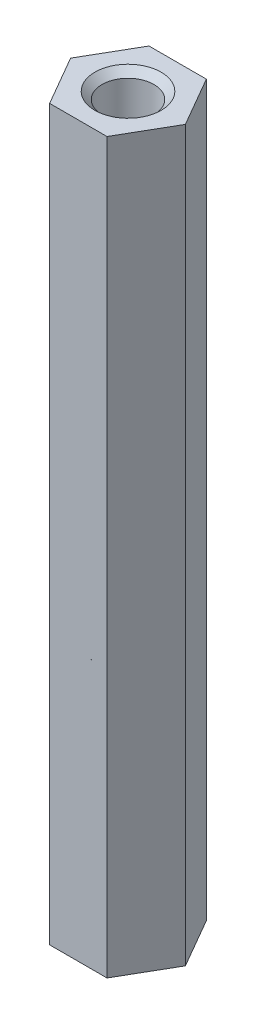
ISO-10303-21;
HEADER;
FILE_DESCRIPTION(('STEP AP214'),'2;1');
FILE_NAME('part.step','',(''),(''),'','','');
FILE_SCHEMA(('AUTOMOTIVE_DESIGN { 1 0 10303 214 1 1 1 1 }'));
ENDSEC;
DATA;
#1=APPLICATION_CONTEXT('core data for automotive mechanical design processes');
#2=APPLICATION_PROTOCOL_DEFINITION('international standard','automotive_design',2000,#1);
#3=PRODUCT_CONTEXT('',#1,'mechanical');
#4=PRODUCT('Part','Part','',(#3));
#5=PRODUCT_RELATED_PRODUCT_CATEGORY('part','',(#4));
#6=PRODUCT_DEFINITION_FORMATION('','',#4);
#7=PRODUCT_DEFINITION_CONTEXT('part definition',#1,'design');
#8=PRODUCT_DEFINITION('design','',#6,#7);
#9=PRODUCT_DEFINITION_SHAPE('','',#8);
#10=(LENGTH_UNIT() NAMED_UNIT(*) SI_UNIT(.MILLI.,.METRE.));
#11=(NAMED_UNIT(*) PLANE_ANGLE_UNIT() SI_UNIT($,.RADIAN.));
#12=(NAMED_UNIT(*) SI_UNIT($,.STERADIAN.) SOLID_ANGLE_UNIT());
#13=UNCERTAINTY_MEASURE_WITH_UNIT(LENGTH_MEASURE(1.E-05),#10,'distance_accuracy_value','');
#14=(GEOMETRIC_REPRESENTATION_CONTEXT(3) GLOBAL_UNCERTAINTY_ASSIGNED_CONTEXT((#13)) GLOBAL_UNIT_ASSIGNED_CONTEXT((#10,
#11,#12)) REPRESENTATION_CONTEXT('',''));
#15=CARTESIAN_POINT('',(0.,0.,0.));
#16=DIRECTION('',(0.,0.,1.));
#17=DIRECTION('',(1.,0.,0.));
#18=AXIS2_PLACEMENT_3D('',#15,#16,#17);
#19=CARTESIAN_POINT('',(0.866025403784438,22.,-1.5));
#20=DIRECTION('',(0.,0.,1.));
#21=DIRECTION('',(1.,0.,0.));
#22=AXIS2_PLACEMENT_3D('',#19,#20,#21);
#23=PLANE('',#22);
#24=DIRECTION('',(0.,1.,0.));
#25=VECTOR('',#24,1.);
#26=CARTESIAN_POINT('',(-0.866025403784439,22.,-1.5));
#27=LINE('',#26,#25);
#28=CARTESIAN_POINT('',(-0.866025403784438,0.,-1.5));
#29=VERTEX_POINT('',#28);
#30=CARTESIAN_POINT('',(-0.866025403784438,22.,-1.5));
#31=VERTEX_POINT('',#30);
#32=EDGE_CURVE('E83',#29,#31,#27,.T.);
#33=ORIENTED_EDGE('',*,*,#32,.T.);
#34=DIRECTION('',(1.,0.,0.));
#35=VECTOR('',#34,1.);
#36=CARTESIAN_POINT('',(0.866025403784438,22.,-1.5));
#37=LINE('',#36,#35);
#38=CARTESIAN_POINT('',(0.866025403784438,22.,-1.5));
#39=VERTEX_POINT('',#38);
#40=EDGE_CURVE('E71',#39,#31,#37,.F.);
#41=ORIENTED_EDGE('',*,*,#40,.F.);
#42=DIRECTION('',(0.,1.,0.));
#43=VECTOR('',#42,1.);
#44=CARTESIAN_POINT('',(0.866025403784438,22.,-1.5));
#45=LINE('',#44,#43);
#46=CARTESIAN_POINT('',(0.866025403784438,0.,-1.5));
#47=VERTEX_POINT('',#46);
#48=EDGE_CURVE('E126',#39,#47,#45,.F.);
#49=ORIENTED_EDGE('',*,*,#48,.T.);
#50=DIRECTION('',(1.,0.,0.));
#51=VECTOR('',#50,1.);
#52=CARTESIAN_POINT('',(0.866025403784438,0.,-1.5));
#53=LINE('',#52,#51);
#54=EDGE_CURVE('E67',#29,#47,#53,.T.);
#55=ORIENTED_EDGE('',*,*,#54,.F.);
#56=EDGE_LOOP('',(#33,#41,#49,#55));
#57=FACE_BOUND('',#56,.T.);
#58=ADVANCED_FACE('F17',(#57),#23,.F.);
#59=CARTESIAN_POINT('',(-0.866025403784439,22.,-1.5));
#60=DIRECTION('',(0.866025403784439,0.,0.5));
#61=DIRECTION('',(0.5,0.,-0.866025403784439));
#62=AXIS2_PLACEMENT_3D('',#59,#60,#61);
#63=PLANE('',#62);
#64=DIRECTION('',(0.,1.,0.));
#65=VECTOR('',#64,1.);
#66=CARTESIAN_POINT('',(-1.73205080756888,22.,0.));
#67=LINE('',#66,#65);
#68=CARTESIAN_POINT('',(-1.73205080756888,0.,0.));
#69=VERTEX_POINT('',#68);
#70=CARTESIAN_POINT('',(-1.73205080756888,22.,0.));
#71=VERTEX_POINT('',#70);
#72=EDGE_CURVE('E86',#69,#71,#67,.T.);
#73=ORIENTED_EDGE('',*,*,#72,.T.);
#74=DIRECTION('',(0.5,0.,-0.866025403784439));
#75=VECTOR('',#74,1.);
#76=CARTESIAN_POINT('',(-0.866025403784439,22.,-1.5));
#77=LINE('',#76,#75);
#78=EDGE_CURVE('E75',#31,#71,#77,.F.);
#79=ORIENTED_EDGE('',*,*,#78,.F.);
#80=ORIENTED_EDGE('',*,*,#32,.F.);
#81=DIRECTION('',(0.5,0.,-0.866025403784439));
#82=VECTOR('',#81,1.);
#83=CARTESIAN_POINT('',(-0.866025403784439,0.,-1.5));
#84=LINE('',#83,#82);
#85=EDGE_CURVE('E87',#69,#29,#84,.T.);
#86=ORIENTED_EDGE('',*,*,#85,.F.);
#87=EDGE_LOOP('',(#73,#79,#80,#86));
#88=FACE_BOUND('',#87,.T.);
#89=ADVANCED_FACE('F82',(#88),#63,.F.);
#90=CARTESIAN_POINT('',(1.7320508075689,22.,0.));
#91=DIRECTION('',(-0.866025403784434,0.,0.500000000000008));
#92=DIRECTION('',(0.500000000000008,0.,0.866025403784434));
#93=AXIS2_PLACEMENT_3D('',#90,#91,#92);
#94=PLANE('',#93);
#95=ORIENTED_EDGE('',*,*,#48,.F.);
#96=DIRECTION('',(0.500000000000008,0.,0.866025403784434));
#97=VECTOR('',#96,1.);
#98=CARTESIAN_POINT('',(1.7320508075689,22.,0.));
#99=LINE('',#98,#97);
#100=CARTESIAN_POINT('',(1.7320508075689,22.,0.));
#101=VERTEX_POINT('',#100);
#102=EDGE_CURVE('E77',#101,#39,#99,.F.);
#103=ORIENTED_EDGE('',*,*,#102,.F.);
#104=DIRECTION('',(0.,1.,0.));
#105=VECTOR('',#104,1.);
#106=CARTESIAN_POINT('',(1.7320508075689,22.,0.));
#107=LINE('',#106,#105);
#108=CARTESIAN_POINT('',(1.7320508075689,0.,0.));
#109=VERTEX_POINT('',#108);
#110=EDGE_CURVE('E113',#101,#109,#107,.F.);
#111=ORIENTED_EDGE('',*,*,#110,.T.);
#112=DIRECTION('',(0.500000000000008,0.,0.866025403784434));
#113=VECTOR('',#112,1.);
#114=CARTESIAN_POINT('',(1.7320508075689,0.,0.));
#115=LINE('',#114,#113);
#116=EDGE_CURVE('E124',#47,#109,#115,.T.);
#117=ORIENTED_EDGE('',*,*,#116,.F.);
#118=EDGE_LOOP('',(#95,#103,#111,#117));
#119=FACE_BOUND('',#118,.T.);
#120=ADVANCED_FACE('F143',(#119),#94,.F.);
#121=CARTESIAN_POINT('',(-1.73205080756888,22.,0.));
#122=DIRECTION('',(0.866025403784439,0.,-0.5));
#123=DIRECTION('',(-0.5,0.,-0.866025403784439));
#124=AXIS2_PLACEMENT_3D('',#121,#122,#123);
#125=PLANE('',#124);
#126=DIRECTION('',(0.,1.,0.));
#127=VECTOR('',#126,1.);
#128=CARTESIAN_POINT('',(-0.866025403784439,22.,1.5));
#129=LINE('',#128,#127);
#130=CARTESIAN_POINT('',(-0.866025403784439,0.,1.5));
#131=VERTEX_POINT('',#130);
#132=CARTESIAN_POINT('',(-0.866025403784439,22.,1.5));
#133=VERTEX_POINT('',#132);
#134=EDGE_CURVE('E112',#131,#133,#129,.T.);
#135=ORIENTED_EDGE('',*,*,#134,.T.);
#136=DIRECTION('',(-0.5,0.,-0.866025403784439));
#137=VECTOR('',#136,1.);
#138=CARTESIAN_POINT('',(-1.73205080756888,22.,0.));
#139=LINE('',#138,#137);
#140=EDGE_CURVE('E35',#71,#133,#139,.F.);
#141=ORIENTED_EDGE('',*,*,#140,.F.);
#142=ORIENTED_EDGE('',*,*,#72,.F.);
#143=DIRECTION('',(-0.5,0.,-0.866025403784439));
#144=VECTOR('',#143,1.);
#145=CARTESIAN_POINT('',(-1.73205080756888,0.,0.));
#146=LINE('',#145,#144);
#147=EDGE_CURVE('E119',#131,#69,#146,.T.);
#148=ORIENTED_EDGE('',*,*,#147,.F.);
#149=EDGE_LOOP('',(#135,#141,#142,#148));
#150=FACE_BOUND('',#149,.T.);
#151=ADVANCED_FACE('F133',(#150),#125,.F.);
#152=CARTESIAN_POINT('',(0.866025403784439,22.,1.5));
#153=DIRECTION('',(-0.866025403784432,0.,-0.500000000000011));
#154=DIRECTION('',(-0.500000000000011,0.,0.866025403784432));
#155=AXIS2_PLACEMENT_3D('',#152,#153,#154);
#156=PLANE('',#155);
#157=ORIENTED_EDGE('',*,*,#110,.F.);
#158=DIRECTION('',(-0.500000000000011,0.,0.866025403784432));
#159=VECTOR('',#158,1.);
#160=CARTESIAN_POINT('',(0.866025403784439,22.,1.5));
#161=LINE('',#160,#159);
#162=CARTESIAN_POINT('',(0.866025403784439,22.,1.5));
#163=VERTEX_POINT('',#162);
#164=EDGE_CURVE('E117',#163,#101,#161,.F.);
#165=ORIENTED_EDGE('',*,*,#164,.F.);
#166=DIRECTION('',(0.,1.,0.));
#167=VECTOR('',#166,1.);
#168=CARTESIAN_POINT('',(0.866025403784439,22.,1.5));
#169=LINE('',#168,#167);
#170=CARTESIAN_POINT('',(0.866025403784439,0.,1.5));
#171=VERTEX_POINT('',#170);
#172=EDGE_CURVE('E109',#163,#171,#169,.F.);
#173=ORIENTED_EDGE('',*,*,#172,.T.);
#174=DIRECTION('',(0.500000000000011,0.,-0.866025403784432));
#175=VECTOR('',#174,1.);
#176=CARTESIAN_POINT('',(0.866025403784439,0.,1.5));
#177=LINE('',#176,#175);
#178=EDGE_CURVE('E101',#171,#109,#177,.T.);
#179=ORIENTED_EDGE('',*,*,#178,.T.);
#180=EDGE_LOOP('',(#157,#165,#173,#179));
#181=FACE_BOUND('',#180,.T.);
#182=ADVANCED_FACE('F141',(#181),#156,.F.);
#183=CARTESIAN_POINT('',(-0.866025403784439,22.,1.5));
#184=DIRECTION('',(0.,0.,-1.));
#185=DIRECTION('',(-1.,0.,0.));
#186=AXIS2_PLACEMENT_3D('',#183,#184,#185);
#187=PLANE('',#186);
#188=ORIENTED_EDGE('',*,*,#172,.F.);
#189=DIRECTION('',(1.,0.,0.));
#190=VECTOR('',#189,1.);
#191=CARTESIAN_POINT('',(0.,22.,1.5));
#192=LINE('',#191,#190);
#193=EDGE_CURVE('E98',#133,#163,#192,.T.);
#194=ORIENTED_EDGE('',*,*,#193,.F.);
#195=ORIENTED_EDGE('',*,*,#134,.F.);
#196=DIRECTION('',(1.,0.,0.));
#197=VECTOR('',#196,1.);
#198=CARTESIAN_POINT('',(0.,0.,1.5));
#199=LINE('',#198,#197);
#200=EDGE_CURVE('E105',#131,#171,#199,.T.);
#201=ORIENTED_EDGE('',*,*,#200,.T.);
#202=EDGE_LOOP('',(#188,#194,#195,#201));
#203=FACE_BOUND('',#202,.T.);
#204=ADVANCED_FACE('F137',(#203),#187,.F.);
#205=CARTESIAN_POINT('',(0.,0.,0.));
#206=DIRECTION('',(0.,1.,0.));
#207=DIRECTION('',(0.,0.,1.));
#208=AXIS2_PLACEMENT_3D('',#205,#206,#207);
#209=PLANE('',#208);
#210=ORIENTED_EDGE('',*,*,#200,.F.);
#211=ORIENTED_EDGE('',*,*,#147,.T.);
#212=ORIENTED_EDGE('',*,*,#85,.T.);
#213=ORIENTED_EDGE('',*,*,#54,.T.);
#214=ORIENTED_EDGE('',*,*,#116,.T.);
#215=ORIENTED_EDGE('',*,*,#178,.F.);
#216=EDGE_LOOP('',(#210,#211,#212,#213,#214,#215));
#217=FACE_BOUND('',#216,.T.);
#218=CARTESIAN_POINT('',(0.,0.,0.));
#219=DIRECTION('',(0.,-1.,0.));
#220=DIRECTION('',(0.,0.,-1.));
#221=AXIS2_PLACEMENT_3D('',#218,#219,#220);
#222=CIRCLE('',#221,1.0000000000332);
#223=CARTESIAN_POINT('',(0.,0.,-1.0000000000332));
#224=VERTEX_POINT('',#223);
#225=EDGE_CURVE('E20',#224,#224,#222,.F.);
#226=ORIENTED_EDGE('',*,*,#225,.T.);
#227=EDGE_LOOP('',(#226));
#228=FACE_BOUND('',#227,.T.);
#229=ADVANCED_FACE('F130',(#217,#228),#209,.F.);
#230=CARTESIAN_POINT('',(0.,22.,0.));
#231=DIRECTION('',(0.,1.,0.));
#232=DIRECTION('',(0.,0.,1.));
#233=AXIS2_PLACEMENT_3D('',#230,#231,#232);
#234=PLANE('',#233);
#235=ORIENTED_EDGE('',*,*,#140,.T.);
#236=ORIENTED_EDGE('',*,*,#193,.T.);
#237=ORIENTED_EDGE('',*,*,#164,.T.);
#238=ORIENTED_EDGE('',*,*,#102,.T.);
#239=ORIENTED_EDGE('',*,*,#40,.T.);
#240=ORIENTED_EDGE('',*,*,#78,.T.);
#241=EDGE_LOOP('',(#235,#236,#237,#238,#239,#240));
#242=FACE_BOUND('',#241,.T.);
#243=CARTESIAN_POINT('',(0.,22.0000000000482,0.));
#244=DIRECTION('',(0.,1.,0.));
#245=DIRECTION('',(0.,0.,1.));
#246=AXIS2_PLACEMENT_3D('',#243,#244,#245);
#247=CIRCLE('',#246,0.999999999976353);
#248=CARTESIAN_POINT('',(0.,22.0000000000482,0.999999999976353));
#249=VERTEX_POINT('',#248);
#250=EDGE_CURVE('E92',#249,#249,#247,.F.);
#251=ORIENTED_EDGE('',*,*,#250,.T.);
#252=EDGE_LOOP('',(#251));
#253=FACE_BOUND('',#252,.T.);
#254=ADVANCED_FACE('F73',(#242,#253),#234,.T.);
#255=CARTESIAN_POINT('',(0.,1.13686837721616E-10,0.));
#256=DIRECTION('',(0.,-1.,0.));
#257=DIRECTION('',(0.,0.,-1.));
#258=AXIS2_PLACEMENT_3D('',#255,#256,#257);
#259=CONICAL_SURFACE('',#258,0.99999999991951,0.785398163397448);
#260=ORIENTED_EDGE('',*,*,#225,.F.);
#261=EDGE_LOOP('',(#260));
#262=FACE_BOUND('',#261,.T.);
#263=CARTESIAN_POINT('',(0.,0.215,0.));
#264=DIRECTION('',(0.,-1.,0.));
#265=DIRECTION('',(0.,0.,-1.));
#266=AXIS2_PLACEMENT_3D('',#263,#264,#265);
#267=CIRCLE('',#266,0.785);
#268=CARTESIAN_POINT('',(0.,0.215,-0.785));
#269=VERTEX_POINT('',#268);
#270=EDGE_CURVE('E26',#269,#269,#267,.F.);
#271=ORIENTED_EDGE('',*,*,#270,.T.);
#272=EDGE_LOOP('',(#271));
#273=FACE_BOUND('',#272,.T.);
#274=ADVANCED_FACE('F160',(#262,#273),#259,.F.);
#275=CARTESIAN_POINT('',(0.,22.0000000000482,0.));
#276=DIRECTION('',(0.,1.,0.));
#277=DIRECTION('',(0.,0.,1.));
#278=AXIS2_PLACEMENT_3D('',#275,#276,#277);
#279=CONICAL_SURFACE('',#278,0.999999999976353,0.785398163265254);
#280=CARTESIAN_POINT('',(0.,21.785,0.));
#281=DIRECTION('',(0.,-1.,0.));
#282=DIRECTION('',(0.,0.,-1.));
#283=AXIS2_PLACEMENT_3D('',#280,#281,#282);
#284=CIRCLE('',#283,0.785);
#285=CARTESIAN_POINT('',(0.,21.785,-0.785));
#286=VERTEX_POINT('',#285);
#287=EDGE_CURVE('E11',#286,#286,#284,.T.);
#288=ORIENTED_EDGE('',*,*,#287,.T.);
#289=EDGE_LOOP('',(#288));
#290=FACE_BOUND('',#289,.T.);
#291=ORIENTED_EDGE('',*,*,#250,.F.);
#292=EDGE_LOOP('',(#291));
#293=FACE_BOUND('',#292,.T.);
#294=ADVANCED_FACE('F154',(#290,#293),#279,.F.);
#295=CARTESIAN_POINT('',(0.,22.,0.));
#296=DIRECTION('',(0.,-1.,0.));
#297=DIRECTION('',(0.,0.,-1.));
#298=AXIS2_PLACEMENT_3D('',#295,#296,#297);
#299=CYLINDRICAL_SURFACE('',#298,0.785);
#300=ORIENTED_EDGE('',*,*,#270,.F.);
#301=EDGE_LOOP('',(#300));
#302=FACE_BOUND('',#301,.T.);
#303=ORIENTED_EDGE('',*,*,#287,.F.);
#304=EDGE_LOOP('',(#303));
#305=FACE_BOUND('',#304,.T.);
#306=ADVANCED_FACE('F152',(#302,#305),#299,.F.);
#307=CLOSED_SHELL('',(#58,#89,#120,#151,#182,#204,#229,#254,#274,#294,#306));
#308=MANIFOLD_SOLID_BREP('B1',#307);
#309=ADVANCED_BREP_SHAPE_REPRESENTATION('',(#18,#308),#14);
#310=SHAPE_DEFINITION_REPRESENTATION(#9,#309);
ENDSEC;
END-ISO-10303-21;
